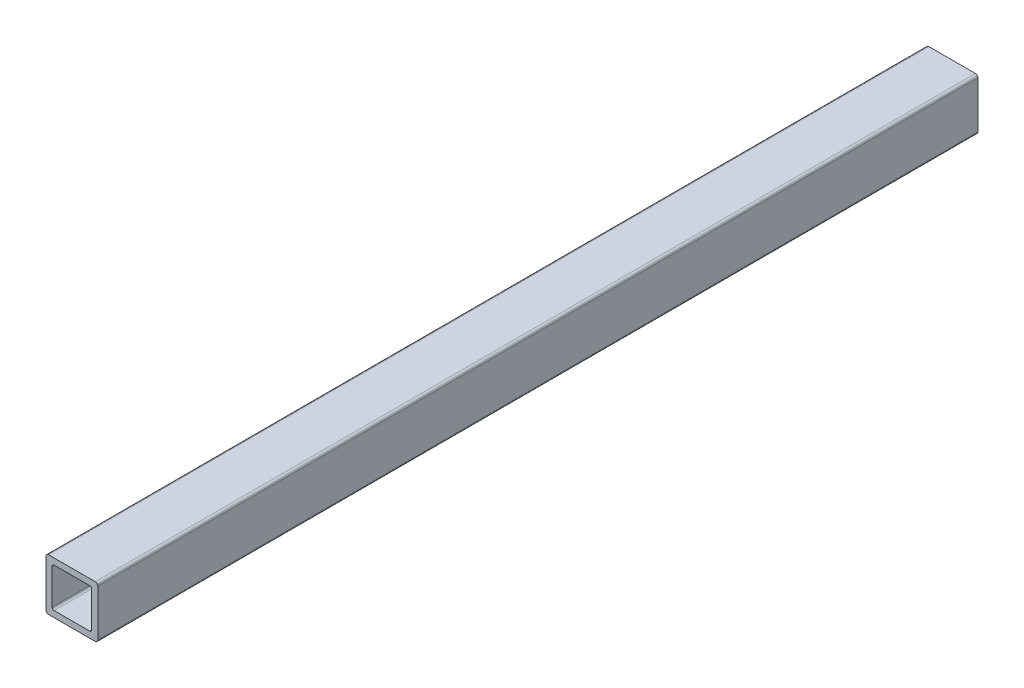
ISO-10303-21;
HEADER;
FILE_DESCRIPTION(('STEP AP214'),'2;1');
FILE_NAME('part.step','',(''),(''),'','','');
FILE_SCHEMA(('AUTOMOTIVE_DESIGN { 1 0 10303 214 1 1 1 1 }'));
ENDSEC;
DATA;
#1=APPLICATION_CONTEXT('core data for automotive mechanical design processes');
#2=APPLICATION_PROTOCOL_DEFINITION('international standard','automotive_design',2000,#1);
#3=PRODUCT_CONTEXT('',#1,'mechanical');
#4=PRODUCT('Part','Part','',(#3));
#5=PRODUCT_RELATED_PRODUCT_CATEGORY('part','',(#4));
#6=PRODUCT_DEFINITION_FORMATION('','',#4);
#7=PRODUCT_DEFINITION_CONTEXT('part definition',#1,'design');
#8=PRODUCT_DEFINITION('design','',#6,#7);
#9=PRODUCT_DEFINITION_SHAPE('','',#8);
#10=(LENGTH_UNIT() NAMED_UNIT(*) SI_UNIT(.MILLI.,.METRE.));
#11=(NAMED_UNIT(*) PLANE_ANGLE_UNIT() SI_UNIT($,.RADIAN.));
#12=(NAMED_UNIT(*) SI_UNIT($,.STERADIAN.) SOLID_ANGLE_UNIT());
#13=UNCERTAINTY_MEASURE_WITH_UNIT(LENGTH_MEASURE(1.E-05),#10,'distance_accuracy_value','');
#14=(GEOMETRIC_REPRESENTATION_CONTEXT(3) GLOBAL_UNCERTAINTY_ASSIGNED_CONTEXT((#13)) GLOBAL_UNIT_ASSIGNED_CONTEXT((#10,
#11,#12)) REPRESENTATION_CONTEXT('',''));
#15=CARTESIAN_POINT('',(0.,0.,0.));
#16=DIRECTION('',(0.,0.,1.));
#17=DIRECTION('',(1.,0.,0.));
#18=AXIS2_PLACEMENT_3D('',#15,#16,#17);
#19=CARTESIAN_POINT('',(11.43,-11.43,431.8));
#20=DIRECTION('',(0.,0.,1.));
#21=DIRECTION('',(1.,0.,0.));
#22=AXIS2_PLACEMENT_3D('',#19,#20,#21);
#23=PLANE('',#22);
#24=CARTESIAN_POINT('',(11.43,-11.43,431.8));
#25=DIRECTION('',(0.,0.,1.));
#26=DIRECTION('',(1.,0.,0.));
#27=AXIS2_PLACEMENT_3D('',#24,#25,#26);
#28=CIRCLE('',#27,1.27);
#29=CARTESIAN_POINT('',(11.43,-12.7,431.8));
#30=VERTEX_POINT('',#29);
#31=CARTESIAN_POINT('',(12.7,-11.43,431.8));
#32=VERTEX_POINT('',#31);
#33=EDGE_CURVE('E244',#30,#32,#28,.T.);
#34=ORIENTED_EDGE('',*,*,#33,.T.);
#35=DIRECTION('',(0.,1.,0.));
#36=VECTOR('',#35,1.);
#37=CARTESIAN_POINT('',(12.7,-11.43,431.8));
#38=LINE('',#37,#36);
#39=CARTESIAN_POINT('',(12.7,11.43,431.8));
#40=VERTEX_POINT('',#39);
#41=EDGE_CURVE('E248',#32,#40,#38,.T.);
#42=ORIENTED_EDGE('',*,*,#41,.T.);
#43=CARTESIAN_POINT('',(11.43,11.43,431.8));
#44=DIRECTION('',(0.,0.,1.));
#45=DIRECTION('',(1.,0.,0.));
#46=AXIS2_PLACEMENT_3D('',#43,#44,#45);
#47=CIRCLE('',#46,1.27);
#48=CARTESIAN_POINT('',(11.43,12.7,431.8));
#49=VERTEX_POINT('',#48);
#50=EDGE_CURVE('E252',#40,#49,#47,.T.);
#51=ORIENTED_EDGE('',*,*,#50,.T.);
#52=DIRECTION('',(-1.,0.,0.));
#53=VECTOR('',#52,1.);
#54=CARTESIAN_POINT('',(11.43,12.7,431.8));
#55=LINE('',#54,#53);
#56=CARTESIAN_POINT('',(-11.43,12.7,431.8));
#57=VERTEX_POINT('',#56);
#58=EDGE_CURVE('E255',#49,#57,#55,.T.);
#59=ORIENTED_EDGE('',*,*,#58,.T.);
#60=CARTESIAN_POINT('',(-11.43,11.43,431.8));
#61=DIRECTION('',(0.,0.,1.));
#62=DIRECTION('',(1.,0.,0.));
#63=AXIS2_PLACEMENT_3D('',#60,#61,#62);
#64=CIRCLE('',#63,1.27);
#65=CARTESIAN_POINT('',(-12.7,11.43,431.8));
#66=VERTEX_POINT('',#65);
#67=EDGE_CURVE('E258',#57,#66,#64,.T.);
#68=ORIENTED_EDGE('',*,*,#67,.T.);
#69=DIRECTION('',(0.,-1.,0.));
#70=VECTOR('',#69,1.);
#71=CARTESIAN_POINT('',(-12.7,-11.43,431.8));
#72=LINE('',#71,#70);
#73=CARTESIAN_POINT('',(-12.7,-11.43,431.8));
#74=VERTEX_POINT('',#73);
#75=EDGE_CURVE('E261',#66,#74,#72,.T.);
#76=ORIENTED_EDGE('',*,*,#75,.T.);
#77=CARTESIAN_POINT('',(-11.43,-11.43,431.8));
#78=DIRECTION('',(0.,0.,1.));
#79=DIRECTION('',(1.,0.,0.));
#80=AXIS2_PLACEMENT_3D('',#77,#78,#79);
#81=CIRCLE('',#80,1.27);
#82=CARTESIAN_POINT('',(-11.43,-12.7,431.8));
#83=VERTEX_POINT('',#82);
#84=EDGE_CURVE('E264',#74,#83,#81,.T.);
#85=ORIENTED_EDGE('',*,*,#84,.T.);
#86=DIRECTION('',(1.,0.,0.));
#87=VECTOR('',#86,1.);
#88=CARTESIAN_POINT('',(11.43,-12.7,431.8));
#89=LINE('',#88,#87);
#90=EDGE_CURVE('E267',#83,#30,#89,.T.);
#91=ORIENTED_EDGE('',*,*,#90,.T.);
#92=EDGE_LOOP('',(#34,#42,#51,#59,#68,#76,#85,#91));
#93=FACE_BOUND('',#92,.T.);
#94=DIRECTION('',(-1.,0.,0.));
#95=VECTOR('',#94,1.);
#96=CARTESIAN_POINT('',(8.6868,9.652,431.8));
#97=LINE('',#96,#95);
#98=CARTESIAN_POINT('',(8.6868,9.652,431.8));
#99=VERTEX_POINT('',#98);
#100=CARTESIAN_POINT('',(-8.6868,9.652,431.8));
#101=VERTEX_POINT('',#100);
#102=EDGE_CURVE('E164',#99,#101,#97,.T.);
#103=ORIENTED_EDGE('',*,*,#102,.F.);
#104=CARTESIAN_POINT('',(8.6868,8.6868,431.8));
#105=DIRECTION('',(0.,0.,1.));
#106=DIRECTION('',(1.,0.,0.));
#107=AXIS2_PLACEMENT_3D('',#104,#105,#106);
#108=CIRCLE('',#107,0.965199999999998);
#109=CARTESIAN_POINT('',(9.652,8.6868,431.8));
#110=VERTEX_POINT('',#109);
#111=EDGE_CURVE('E155',#110,#99,#108,.T.);
#112=ORIENTED_EDGE('',*,*,#111,.F.);
#113=DIRECTION('',(0.,1.,0.));
#114=VECTOR('',#113,1.);
#115=CARTESIAN_POINT('',(9.652,8.6868,431.8));
#116=LINE('',#115,#114);
#117=CARTESIAN_POINT('',(9.652,-8.6868,431.8));
#118=VERTEX_POINT('',#117);
#119=EDGE_CURVE('E196',#118,#110,#116,.T.);
#120=ORIENTED_EDGE('',*,*,#119,.F.);
#121=CARTESIAN_POINT('',(8.6868,-8.6868,431.8));
#122=DIRECTION('',(0.,0.,1.));
#123=DIRECTION('',(1.,0.,0.));
#124=AXIS2_PLACEMENT_3D('',#121,#122,#123);
#125=CIRCLE('',#124,0.965199999999999);
#126=CARTESIAN_POINT('',(8.6868,-9.652,431.8));
#127=VERTEX_POINT('',#126);
#128=EDGE_CURVE('E193',#127,#118,#125,.T.);
#129=ORIENTED_EDGE('',*,*,#128,.F.);
#130=DIRECTION('',(1.,0.,0.));
#131=VECTOR('',#130,1.);
#132=CARTESIAN_POINT('',(8.6868,-9.652,431.8));
#133=LINE('',#132,#131);
#134=CARTESIAN_POINT('',(-8.6868,-9.652,431.8));
#135=VERTEX_POINT('',#134);
#136=EDGE_CURVE('E190',#135,#127,#133,.T.);
#137=ORIENTED_EDGE('',*,*,#136,.F.);
#138=CARTESIAN_POINT('',(-8.6868,-8.6868,431.8));
#139=DIRECTION('',(0.,0.,1.));
#140=DIRECTION('',(1.,0.,0.));
#141=AXIS2_PLACEMENT_3D('',#138,#139,#140);
#142=CIRCLE('',#141,0.965199999999999);
#143=CARTESIAN_POINT('',(-9.652,-8.6868,431.8));
#144=VERTEX_POINT('',#143);
#145=EDGE_CURVE('E187',#144,#135,#142,.T.);
#146=ORIENTED_EDGE('',*,*,#145,.F.);
#147=DIRECTION('',(0.,-1.,0.));
#148=VECTOR('',#147,1.);
#149=CARTESIAN_POINT('',(-9.652,8.6868,431.8));
#150=LINE('',#149,#148);
#151=CARTESIAN_POINT('',(-9.652,8.6868,431.8));
#152=VERTEX_POINT('',#151);
#153=EDGE_CURVE('E182',#152,#144,#150,.T.);
#154=ORIENTED_EDGE('',*,*,#153,.F.);
#155=CARTESIAN_POINT('',(-8.6868,8.6868,431.8));
#156=DIRECTION('',(0.,0.,1.));
#157=DIRECTION('',(1.,0.,0.));
#158=AXIS2_PLACEMENT_3D('',#155,#156,#157);
#159=CIRCLE('',#158,0.965199999999999);
#160=EDGE_CURVE('E178',#101,#152,#159,.T.);
#161=ORIENTED_EDGE('',*,*,#160,.F.);
#162=EDGE_LOOP('',(#103,#112,#120,#129,#137,#146,#154,#161));
#163=FACE_BOUND('',#162,.T.);
#164=ADVANCED_FACE('F41',(#93,#163),#23,.T.);
#165=CARTESIAN_POINT('',(11.43,-11.43,0.));
#166=DIRECTION('',(0.,0.,1.));
#167=DIRECTION('',(1.,0.,0.));
#168=AXIS2_PLACEMENT_3D('',#165,#166,#167);
#169=PLANE('',#168);
#170=CARTESIAN_POINT('',(11.43,-11.43,0.));
#171=DIRECTION('',(0.,0.,1.));
#172=DIRECTION('',(1.,0.,0.));
#173=AXIS2_PLACEMENT_3D('',#170,#171,#172);
#174=CIRCLE('',#173,1.27);
#175=CARTESIAN_POINT('',(11.43,-12.7,0.));
#176=VERTEX_POINT('',#175);
#177=CARTESIAN_POINT('',(12.7,-11.43,0.));
#178=VERTEX_POINT('',#177);
#179=EDGE_CURVE('E173',#176,#178,#174,.T.);
#180=ORIENTED_EDGE('',*,*,#179,.F.);
#181=DIRECTION('',(1.,0.,0.));
#182=VECTOR('',#181,1.);
#183=CARTESIAN_POINT('',(11.43,-12.7,0.));
#184=LINE('',#183,#182);
#185=CARTESIAN_POINT('',(-11.43,-12.7,0.));
#186=VERTEX_POINT('',#185);
#187=EDGE_CURVE('E249',#186,#176,#184,.T.);
#188=ORIENTED_EDGE('',*,*,#187,.F.);
#189=CARTESIAN_POINT('',(-11.43,-11.43,0.));
#190=DIRECTION('',(0.,0.,1.));
#191=DIRECTION('',(1.,0.,0.));
#192=AXIS2_PLACEMENT_3D('',#189,#190,#191);
#193=CIRCLE('',#192,1.27);
#194=CARTESIAN_POINT('',(-12.7,-11.43,0.));
#195=VERTEX_POINT('',#194);
#196=EDGE_CURVE('E289',#195,#186,#193,.T.);
#197=ORIENTED_EDGE('',*,*,#196,.F.);
#198=DIRECTION('',(0.,-1.,0.));
#199=VECTOR('',#198,1.);
#200=CARTESIAN_POINT('',(-12.7,-11.43,0.));
#201=LINE('',#200,#199);
#202=CARTESIAN_POINT('',(-12.7,11.43,0.));
#203=VERTEX_POINT('',#202);
#204=EDGE_CURVE('E286',#203,#195,#201,.T.);
#205=ORIENTED_EDGE('',*,*,#204,.F.);
#206=CARTESIAN_POINT('',(-11.43,11.43,0.));
#207=DIRECTION('',(0.,0.,1.));
#208=DIRECTION('',(1.,0.,0.));
#209=AXIS2_PLACEMENT_3D('',#206,#207,#208);
#210=CIRCLE('',#209,1.27);
#211=CARTESIAN_POINT('',(-11.43,12.7,0.));
#212=VERTEX_POINT('',#211);
#213=EDGE_CURVE('E283',#212,#203,#210,.T.);
#214=ORIENTED_EDGE('',*,*,#213,.F.);
#215=DIRECTION('',(-1.,0.,0.));
#216=VECTOR('',#215,1.);
#217=CARTESIAN_POINT('',(11.43,12.7,0.));
#218=LINE('',#217,#216);
#219=CARTESIAN_POINT('',(11.43,12.7,0.));
#220=VERTEX_POINT('',#219);
#221=EDGE_CURVE('E280',#220,#212,#218,.T.);
#222=ORIENTED_EDGE('',*,*,#221,.F.);
#223=CARTESIAN_POINT('',(11.43,11.43,0.));
#224=DIRECTION('',(0.,0.,1.));
#225=DIRECTION('',(1.,0.,0.));
#226=AXIS2_PLACEMENT_3D('',#223,#224,#225);
#227=CIRCLE('',#226,1.27);
#228=CARTESIAN_POINT('',(12.7,11.43,0.));
#229=VERTEX_POINT('',#228);
#230=EDGE_CURVE('E277',#229,#220,#227,.T.);
#231=ORIENTED_EDGE('',*,*,#230,.F.);
#232=DIRECTION('',(0.,1.,0.));
#233=VECTOR('',#232,1.);
#234=CARTESIAN_POINT('',(12.7,-11.43,0.));
#235=LINE('',#234,#233);
#236=EDGE_CURVE('E274',#178,#229,#235,.T.);
#237=ORIENTED_EDGE('',*,*,#236,.F.);
#238=EDGE_LOOP('',(#180,#188,#197,#205,#214,#222,#231,#237));
#239=FACE_BOUND('',#238,.T.);
#240=CARTESIAN_POINT('',(8.6868,8.6868,0.));
#241=DIRECTION('',(0.,0.,1.));
#242=DIRECTION('',(1.,0.,0.));
#243=AXIS2_PLACEMENT_3D('',#240,#241,#242);
#244=CIRCLE('',#243,0.965199999999998);
#245=CARTESIAN_POINT('',(9.652,8.6868,0.));
#246=VERTEX_POINT('',#245);
#247=CARTESIAN_POINT('',(8.6868,9.652,0.));
#248=VERTEX_POINT('',#247);
#249=EDGE_CURVE('E65',#246,#248,#244,.T.);
#250=ORIENTED_EDGE('',*,*,#249,.T.);
#251=DIRECTION('',(-1.,0.,0.));
#252=VECTOR('',#251,1.);
#253=CARTESIAN_POINT('',(8.6868,9.652,0.));
#254=LINE('',#253,#252);
#255=CARTESIAN_POINT('',(-8.6868,9.652,0.));
#256=VERTEX_POINT('',#255);
#257=EDGE_CURVE('E171',#248,#256,#254,.T.);
#258=ORIENTED_EDGE('',*,*,#257,.T.);
#259=CARTESIAN_POINT('',(-8.6868,8.6868,0.));
#260=DIRECTION('',(0.,0.,1.));
#261=DIRECTION('',(1.,0.,0.));
#262=AXIS2_PLACEMENT_3D('',#259,#260,#261);
#263=CIRCLE('',#262,0.965199999999999);
#264=CARTESIAN_POINT('',(-9.652,8.6868,0.));
#265=VERTEX_POINT('',#264);
#266=EDGE_CURVE('E203',#256,#265,#263,.T.);
#267=ORIENTED_EDGE('',*,*,#266,.T.);
#268=DIRECTION('',(0.,-1.,0.));
#269=VECTOR('',#268,1.);
#270=CARTESIAN_POINT('',(-9.652,8.6868,0.));
#271=LINE('',#270,#269);
#272=CARTESIAN_POINT('',(-9.652,-8.6868,0.));
#273=VERTEX_POINT('',#272);
#274=EDGE_CURVE('E207',#265,#273,#271,.T.);
#275=ORIENTED_EDGE('',*,*,#274,.T.);
#276=CARTESIAN_POINT('',(-8.6868,-8.6868,0.));
#277=DIRECTION('',(0.,0.,1.));
#278=DIRECTION('',(1.,0.,0.));
#279=AXIS2_PLACEMENT_3D('',#276,#277,#278);
#280=CIRCLE('',#279,0.965199999999999);
#281=CARTESIAN_POINT('',(-8.6868,-9.652,0.));
#282=VERTEX_POINT('',#281);
#283=EDGE_CURVE('E211',#273,#282,#280,.T.);
#284=ORIENTED_EDGE('',*,*,#283,.T.);
#285=DIRECTION('',(1.,0.,0.));
#286=VECTOR('',#285,1.);
#287=CARTESIAN_POINT('',(8.6868,-9.652,0.));
#288=LINE('',#287,#286);
#289=CARTESIAN_POINT('',(8.6868,-9.652,0.));
#290=VERTEX_POINT('',#289);
#291=EDGE_CURVE('E215',#282,#290,#288,.T.);
#292=ORIENTED_EDGE('',*,*,#291,.T.);
#293=CARTESIAN_POINT('',(8.6868,-8.6868,0.));
#294=DIRECTION('',(0.,0.,1.));
#295=DIRECTION('',(1.,0.,0.));
#296=AXIS2_PLACEMENT_3D('',#293,#294,#295);
#297=CIRCLE('',#296,0.965199999999999);
#298=CARTESIAN_POINT('',(9.652,-8.6868,0.));
#299=VERTEX_POINT('',#298);
#300=EDGE_CURVE('E219',#290,#299,#297,.T.);
#301=ORIENTED_EDGE('',*,*,#300,.T.);
#302=DIRECTION('',(0.,1.,0.));
#303=VECTOR('',#302,1.);
#304=CARTESIAN_POINT('',(9.652,8.6868,0.));
#305=LINE('',#304,#303);
#306=EDGE_CURVE('E165',#299,#246,#305,.T.);
#307=ORIENTED_EDGE('',*,*,#306,.T.);
#308=EDGE_LOOP('',(#250,#258,#267,#275,#284,#292,#301,#307));
#309=FACE_BOUND('',#308,.T.);
#310=ADVANCED_FACE('F328',(#239,#309),#169,.F.);
#311=CARTESIAN_POINT('',(11.43,-11.43,431.8));
#312=DIRECTION('',(0.,0.,-1.));
#313=DIRECTION('',(-1.,0.,0.));
#314=AXIS2_PLACEMENT_3D('',#311,#312,#313);
#315=CYLINDRICAL_SURFACE('',#314,1.27);
#316=ORIENTED_EDGE('',*,*,#179,.T.);
#317=DIRECTION('',(0.,0.,-1.));
#318=VECTOR('',#317,1.);
#319=CARTESIAN_POINT('',(12.7,-11.43,431.8));
#320=LINE('',#319,#318);
#321=EDGE_CURVE('E11',#32,#178,#320,.T.);
#322=ORIENTED_EDGE('',*,*,#321,.F.);
#323=ORIENTED_EDGE('',*,*,#33,.F.);
#324=DIRECTION('',(0.,0.,-1.));
#325=VECTOR('',#324,1.);
#326=CARTESIAN_POINT('',(11.43,-12.7,431.8));
#327=LINE('',#326,#325);
#328=EDGE_CURVE('E270',#30,#176,#327,.T.);
#329=ORIENTED_EDGE('',*,*,#328,.T.);
#330=EDGE_LOOP('',(#316,#322,#323,#329));
#331=FACE_BOUND('',#330,.T.);
#332=ADVANCED_FACE('F43',(#331),#315,.T.);
#333=CARTESIAN_POINT('',(12.7,-11.43,431.8));
#334=DIRECTION('',(-1.,0.,0.));
#335=DIRECTION('',(0.,0.,1.));
#336=AXIS2_PLACEMENT_3D('',#333,#334,#335);
#337=PLANE('',#336);
#338=ORIENTED_EDGE('',*,*,#236,.T.);
#339=DIRECTION('',(0.,0.,-1.));
#340=VECTOR('',#339,1.);
#341=CARTESIAN_POINT('',(12.7,11.43,431.8));
#342=LINE('',#341,#340);
#343=EDGE_CURVE('E50',#40,#229,#342,.T.);
#344=ORIENTED_EDGE('',*,*,#343,.F.);
#345=ORIENTED_EDGE('',*,*,#41,.F.);
#346=ORIENTED_EDGE('',*,*,#321,.T.);
#347=EDGE_LOOP('',(#338,#344,#345,#346));
#348=FACE_BOUND('',#347,.T.);
#349=ADVANCED_FACE('F345',(#348),#337,.F.);
#350=CARTESIAN_POINT('',(11.43,11.43,431.8));
#351=DIRECTION('',(0.,0.,-1.));
#352=DIRECTION('',(-1.,0.,0.));
#353=AXIS2_PLACEMENT_3D('',#350,#351,#352);
#354=CYLINDRICAL_SURFACE('',#353,1.27);
#355=ORIENTED_EDGE('',*,*,#230,.T.);
#356=DIRECTION('',(0.,0.,-1.));
#357=VECTOR('',#356,1.);
#358=CARTESIAN_POINT('',(11.43,12.7,431.8));
#359=LINE('',#358,#357);
#360=EDGE_CURVE('E313',#49,#220,#359,.T.);
#361=ORIENTED_EDGE('',*,*,#360,.F.);
#362=ORIENTED_EDGE('',*,*,#50,.F.);
#363=ORIENTED_EDGE('',*,*,#343,.T.);
#364=EDGE_LOOP('',(#355,#361,#362,#363));
#365=FACE_BOUND('',#364,.T.);
#366=ADVANCED_FACE('F322',(#365),#354,.T.);
#367=CARTESIAN_POINT('',(11.43,12.7,431.8));
#368=DIRECTION('',(0.,-1.,0.));
#369=DIRECTION('',(0.,0.,-1.));
#370=AXIS2_PLACEMENT_3D('',#367,#368,#369);
#371=PLANE('',#370);
#372=ORIENTED_EDGE('',*,*,#221,.T.);
#373=DIRECTION('',(0.,0.,-1.));
#374=VECTOR('',#373,1.);
#375=CARTESIAN_POINT('',(-11.43,12.7,431.8));
#376=LINE('',#375,#374);
#377=EDGE_CURVE('E309',#57,#212,#376,.T.);
#378=ORIENTED_EDGE('',*,*,#377,.F.);
#379=ORIENTED_EDGE('',*,*,#58,.F.);
#380=ORIENTED_EDGE('',*,*,#360,.T.);
#381=EDGE_LOOP('',(#372,#378,#379,#380));
#382=FACE_BOUND('',#381,.T.);
#383=ADVANCED_FACE('F334',(#382),#371,.F.);
#384=CARTESIAN_POINT('',(-11.43,11.43,431.8));
#385=DIRECTION('',(0.,0.,-1.));
#386=DIRECTION('',(-1.,0.,0.));
#387=AXIS2_PLACEMENT_3D('',#384,#385,#386);
#388=CYLINDRICAL_SURFACE('',#387,1.27);
#389=ORIENTED_EDGE('',*,*,#213,.T.);
#390=DIRECTION('',(0.,0.,-1.));
#391=VECTOR('',#390,1.);
#392=CARTESIAN_POINT('',(-12.7,11.43,431.8));
#393=LINE('',#392,#391);
#394=EDGE_CURVE('E305',#66,#203,#393,.T.);
#395=ORIENTED_EDGE('',*,*,#394,.F.);
#396=ORIENTED_EDGE('',*,*,#67,.F.);
#397=ORIENTED_EDGE('',*,*,#377,.T.);
#398=EDGE_LOOP('',(#389,#395,#396,#397));
#399=FACE_BOUND('',#398,.T.);
#400=ADVANCED_FACE('F338',(#399),#388,.T.);
#401=CARTESIAN_POINT('',(-12.7,-11.43,431.8));
#402=DIRECTION('',(1.,0.,0.));
#403=DIRECTION('',(0.,0.,-1.));
#404=AXIS2_PLACEMENT_3D('',#401,#402,#403);
#405=PLANE('',#404);
#406=ORIENTED_EDGE('',*,*,#204,.T.);
#407=DIRECTION('',(0.,0.,-1.));
#408=VECTOR('',#407,1.);
#409=CARTESIAN_POINT('',(-12.7,-11.43,431.8));
#410=LINE('',#409,#408);
#411=EDGE_CURVE('E301',#74,#195,#410,.T.);
#412=ORIENTED_EDGE('',*,*,#411,.F.);
#413=ORIENTED_EDGE('',*,*,#75,.F.);
#414=ORIENTED_EDGE('',*,*,#394,.T.);
#415=EDGE_LOOP('',(#406,#412,#413,#414));
#416=FACE_BOUND('',#415,.T.);
#417=ADVANCED_FACE('F358',(#416),#405,.F.);
#418=CARTESIAN_POINT('',(-11.43,-11.43,431.8));
#419=DIRECTION('',(0.,0.,-1.));
#420=DIRECTION('',(-1.,0.,0.));
#421=AXIS2_PLACEMENT_3D('',#418,#419,#420);
#422=CYLINDRICAL_SURFACE('',#421,1.27);
#423=ORIENTED_EDGE('',*,*,#196,.T.);
#424=DIRECTION('',(0.,0.,-1.));
#425=VECTOR('',#424,1.);
#426=CARTESIAN_POINT('',(-11.43,-12.7,431.8));
#427=LINE('',#426,#425);
#428=EDGE_CURVE('E297',#83,#186,#427,.T.);
#429=ORIENTED_EDGE('',*,*,#428,.F.);
#430=ORIENTED_EDGE('',*,*,#84,.F.);
#431=ORIENTED_EDGE('',*,*,#411,.T.);
#432=EDGE_LOOP('',(#423,#429,#430,#431));
#433=FACE_BOUND('',#432,.T.);
#434=ADVANCED_FACE('F356',(#433),#422,.T.);
#435=CARTESIAN_POINT('',(11.43,-12.7,431.8));
#436=DIRECTION('',(0.,1.,0.));
#437=DIRECTION('',(0.,0.,1.));
#438=AXIS2_PLACEMENT_3D('',#435,#436,#437);
#439=PLANE('',#438);
#440=ORIENTED_EDGE('',*,*,#187,.T.);
#441=ORIENTED_EDGE('',*,*,#328,.F.);
#442=ORIENTED_EDGE('',*,*,#90,.F.);
#443=ORIENTED_EDGE('',*,*,#428,.T.);
#444=EDGE_LOOP('',(#440,#441,#442,#443));
#445=FACE_BOUND('',#444,.T.);
#446=ADVANCED_FACE('F351',(#445),#439,.F.);
#447=CARTESIAN_POINT('',(8.6868,8.6868,431.8));
#448=DIRECTION('',(0.,0.,-1.));
#449=DIRECTION('',(-1.,0.,0.));
#450=AXIS2_PLACEMENT_3D('',#447,#448,#449);
#451=CYLINDRICAL_SURFACE('',#450,0.965199999999998);
#452=ORIENTED_EDGE('',*,*,#249,.F.);
#453=DIRECTION('',(0.,0.,-1.));
#454=VECTOR('',#453,1.);
#455=CARTESIAN_POINT('',(9.652,8.6868,431.8));
#456=LINE('',#455,#454);
#457=EDGE_CURVE('E159',#110,#246,#456,.T.);
#458=ORIENTED_EDGE('',*,*,#457,.F.);
#459=ORIENTED_EDGE('',*,*,#111,.T.);
#460=DIRECTION('',(0.,0.,-1.));
#461=VECTOR('',#460,1.);
#462=CARTESIAN_POINT('',(8.6868,9.652,431.8));
#463=LINE('',#462,#461);
#464=EDGE_CURVE('E158',#99,#248,#463,.T.);
#465=ORIENTED_EDGE('',*,*,#464,.T.);
#466=EDGE_LOOP('',(#452,#458,#459,#465));
#467=FACE_BOUND('',#466,.T.);
#468=ADVANCED_FACE('F157',(#467),#451,.F.);
#469=CARTESIAN_POINT('',(8.6868,9.652,431.8));
#470=DIRECTION('',(0.,-1.,0.));
#471=DIRECTION('',(1.,0.,0.));
#472=AXIS2_PLACEMENT_3D('',#469,#470,#471);
#473=PLANE('',#472);
#474=ORIENTED_EDGE('',*,*,#257,.F.);
#475=ORIENTED_EDGE('',*,*,#464,.F.);
#476=ORIENTED_EDGE('',*,*,#102,.T.);
#477=DIRECTION('',(0.,0.,-1.));
#478=VECTOR('',#477,1.);
#479=CARTESIAN_POINT('',(-8.6868,9.652,431.8));
#480=LINE('',#479,#478);
#481=EDGE_CURVE('E174',#101,#256,#480,.T.);
#482=ORIENTED_EDGE('',*,*,#481,.T.);
#483=EDGE_LOOP('',(#474,#475,#476,#482));
#484=FACE_BOUND('',#483,.T.);
#485=ADVANCED_FACE('F168',(#484),#473,.T.);
#486=CARTESIAN_POINT('',(-8.6868,8.6868,431.8));
#487=DIRECTION('',(0.,0.,-1.));
#488=DIRECTION('',(-1.,0.,0.));
#489=AXIS2_PLACEMENT_3D('',#486,#487,#488);
#490=CYLINDRICAL_SURFACE('',#489,0.965199999999999);
#491=ORIENTED_EDGE('',*,*,#266,.F.);
#492=ORIENTED_EDGE('',*,*,#481,.F.);
#493=ORIENTED_EDGE('',*,*,#160,.T.);
#494=DIRECTION('',(0.,0.,-1.));
#495=VECTOR('',#494,1.);
#496=CARTESIAN_POINT('',(-9.652,8.6868,431.8));
#497=LINE('',#496,#495);
#498=EDGE_CURVE('E239',#152,#265,#497,.T.);
#499=ORIENTED_EDGE('',*,*,#498,.T.);
#500=EDGE_LOOP('',(#491,#492,#493,#499));
#501=FACE_BOUND('',#500,.T.);
#502=ADVANCED_FACE('F383',(#501),#490,.F.);
#503=CARTESIAN_POINT('',(-9.652,8.6868,431.8));
#504=DIRECTION('',(1.,0.,0.));
#505=DIRECTION('',(0.,0.,-1.));
#506=AXIS2_PLACEMENT_3D('',#503,#504,#505);
#507=PLANE('',#506);
#508=ORIENTED_EDGE('',*,*,#274,.F.);
#509=ORIENTED_EDGE('',*,*,#498,.F.);
#510=ORIENTED_EDGE('',*,*,#153,.T.);
#511=DIRECTION('',(0.,0.,-1.));
#512=VECTOR('',#511,1.);
#513=CARTESIAN_POINT('',(-9.652,-8.6868,431.8));
#514=LINE('',#513,#512);
#515=EDGE_CURVE('E236',#144,#273,#514,.T.);
#516=ORIENTED_EDGE('',*,*,#515,.T.);
#517=EDGE_LOOP('',(#508,#509,#510,#516));
#518=FACE_BOUND('',#517,.T.);
#519=ADVANCED_FACE('F387',(#518),#507,.T.);
#520=CARTESIAN_POINT('',(-8.6868,-8.6868,431.8));
#521=DIRECTION('',(0.,0.,-1.));
#522=DIRECTION('',(-1.,0.,0.));
#523=AXIS2_PLACEMENT_3D('',#520,#521,#522);
#524=CYLINDRICAL_SURFACE('',#523,0.965199999999999);
#525=ORIENTED_EDGE('',*,*,#283,.F.);
#526=ORIENTED_EDGE('',*,*,#515,.F.);
#527=ORIENTED_EDGE('',*,*,#145,.T.);
#528=DIRECTION('',(0.,0.,-1.));
#529=VECTOR('',#528,1.);
#530=CARTESIAN_POINT('',(-8.6868,-9.652,431.8));
#531=LINE('',#530,#529);
#532=EDGE_CURVE('E233',#135,#282,#531,.T.);
#533=ORIENTED_EDGE('',*,*,#532,.T.);
#534=EDGE_LOOP('',(#525,#526,#527,#533));
#535=FACE_BOUND('',#534,.T.);
#536=ADVANCED_FACE('F393',(#535),#524,.F.);
#537=CARTESIAN_POINT('',(8.6868,-9.652,431.8));
#538=DIRECTION('',(0.,1.,0.));
#539=DIRECTION('',(-1.,0.,0.));
#540=AXIS2_PLACEMENT_3D('',#537,#538,#539);
#541=PLANE('',#540);
#542=ORIENTED_EDGE('',*,*,#291,.F.);
#543=ORIENTED_EDGE('',*,*,#532,.F.);
#544=ORIENTED_EDGE('',*,*,#136,.T.);
#545=DIRECTION('',(0.,0.,-1.));
#546=VECTOR('',#545,1.);
#547=CARTESIAN_POINT('',(8.6868,-9.652,431.8));
#548=LINE('',#547,#546);
#549=EDGE_CURVE('E230',#127,#290,#548,.T.);
#550=ORIENTED_EDGE('',*,*,#549,.T.);
#551=EDGE_LOOP('',(#542,#543,#544,#550));
#552=FACE_BOUND('',#551,.T.);
#553=ADVANCED_FACE('F397',(#552),#541,.T.);
#554=CARTESIAN_POINT('',(8.6868,-8.6868,431.8));
#555=DIRECTION('',(0.,0.,-1.));
#556=DIRECTION('',(-1.,0.,0.));
#557=AXIS2_PLACEMENT_3D('',#554,#555,#556);
#558=CYLINDRICAL_SURFACE('',#557,0.965199999999999);
#559=ORIENTED_EDGE('',*,*,#300,.F.);
#560=ORIENTED_EDGE('',*,*,#549,.F.);
#561=ORIENTED_EDGE('',*,*,#128,.T.);
#562=DIRECTION('',(0.,0.,-1.));
#563=VECTOR('',#562,1.);
#564=CARTESIAN_POINT('',(9.652,-8.6868,431.8));
#565=LINE('',#564,#563);
#566=EDGE_CURVE('E57',#118,#299,#565,.T.);
#567=ORIENTED_EDGE('',*,*,#566,.T.);
#568=EDGE_LOOP('',(#559,#560,#561,#567));
#569=FACE_BOUND('',#568,.T.);
#570=ADVANCED_FACE('F401',(#569),#558,.F.);
#571=CARTESIAN_POINT('',(9.652,8.6868,431.8));
#572=DIRECTION('',(-1.,0.,0.));
#573=DIRECTION('',(0.,-1.,0.));
#574=AXIS2_PLACEMENT_3D('',#571,#572,#573);
#575=PLANE('',#574);
#576=ORIENTED_EDGE('',*,*,#306,.F.);
#577=ORIENTED_EDGE('',*,*,#566,.F.);
#578=ORIENTED_EDGE('',*,*,#119,.T.);
#579=ORIENTED_EDGE('',*,*,#457,.T.);
#580=EDGE_LOOP('',(#576,#577,#578,#579));
#581=FACE_BOUND('',#580,.T.);
#582=ADVANCED_FACE('F405',(#581),#575,.T.);
#583=CLOSED_SHELL('',(#164,#310,#332,#349,#366,#383,#400,#417,#434,#446,#468,#485,#502,#519,
#536,#553,#570,#582));
#584=MANIFOLD_SOLID_BREP('B2',#583);
#585=ADVANCED_BREP_SHAPE_REPRESENTATION('',(#18,#584),#14);
#586=SHAPE_DEFINITION_REPRESENTATION(#9,#585);
ENDSEC;
END-ISO-10303-21;
